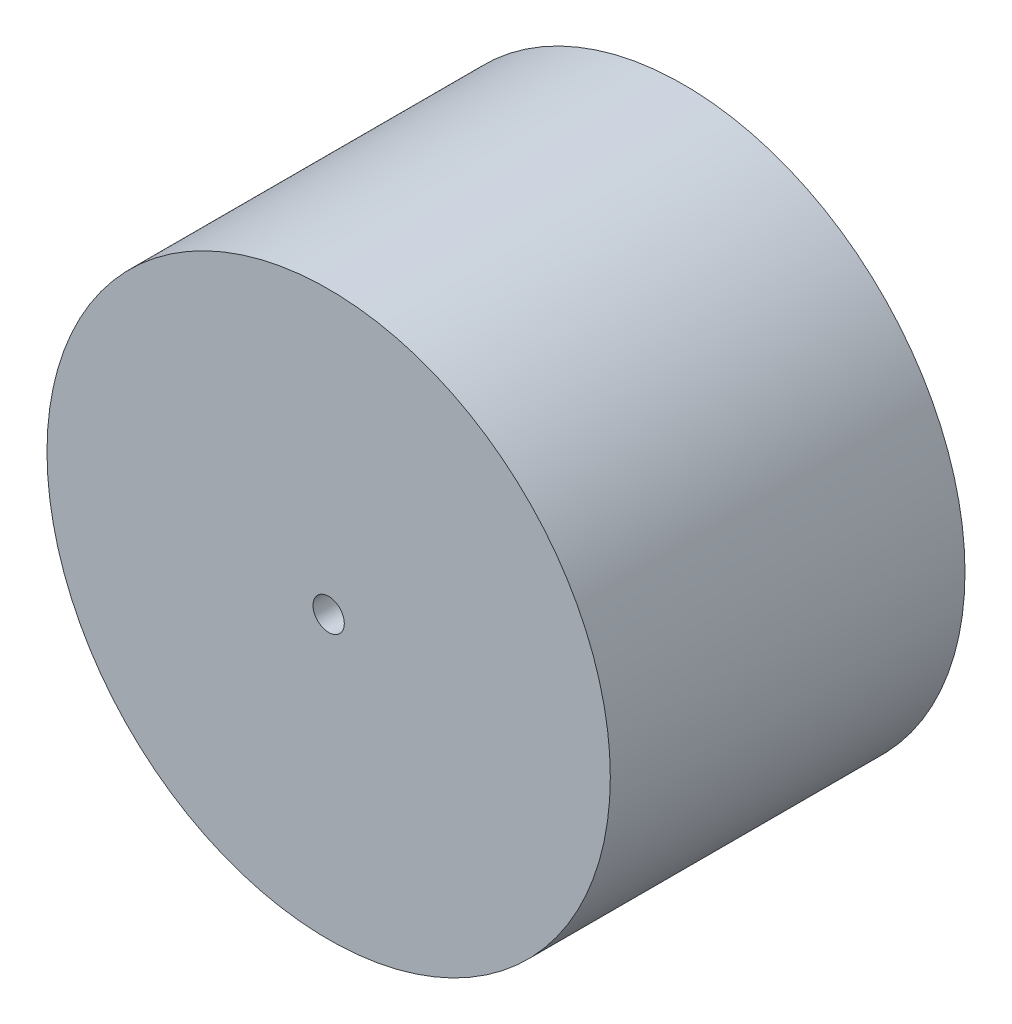
ISO-10303-21;
HEADER;
FILE_DESCRIPTION(('STEP AP214'),'2;1');
FILE_NAME('part.step','',(''),(''),'','','');
FILE_SCHEMA(('AUTOMOTIVE_DESIGN { 1 0 10303 214 1 1 1 1 }'));
ENDSEC;
DATA;
#1=APPLICATION_CONTEXT('core data for automotive mechanical design processes');
#2=APPLICATION_PROTOCOL_DEFINITION('international standard','automotive_design',2000,#1);
#3=PRODUCT_CONTEXT('',#1,'mechanical');
#4=PRODUCT('Part','Part','',(#3));
#5=PRODUCT_RELATED_PRODUCT_CATEGORY('part','',(#4));
#6=PRODUCT_DEFINITION_FORMATION('','',#4);
#7=PRODUCT_DEFINITION_CONTEXT('part definition',#1,'design');
#8=PRODUCT_DEFINITION('design','',#6,#7);
#9=PRODUCT_DEFINITION_SHAPE('','',#8);
#10=(LENGTH_UNIT() NAMED_UNIT(*) SI_UNIT(.MILLI.,.METRE.));
#11=(NAMED_UNIT(*) PLANE_ANGLE_UNIT() SI_UNIT($,.RADIAN.));
#12=(NAMED_UNIT(*) SI_UNIT($,.STERADIAN.) SOLID_ANGLE_UNIT());
#13=UNCERTAINTY_MEASURE_WITH_UNIT(LENGTH_MEASURE(1.E-05),#10,'distance_accuracy_value','');
#14=(GEOMETRIC_REPRESENTATION_CONTEXT(3) GLOBAL_UNCERTAINTY_ASSIGNED_CONTEXT((#13)) GLOBAL_UNIT_ASSIGNED_CONTEXT((#10,
#11,#12)) REPRESENTATION_CONTEXT('',''));
#15=CARTESIAN_POINT('',(0.,0.,0.));
#16=DIRECTION('',(0.,0.,1.));
#17=DIRECTION('',(1.,0.,0.));
#18=AXIS2_PLACEMENT_3D('',#15,#16,#17);
#19=CARTESIAN_POINT('',(0.,0.,34.));
#20=DIRECTION('',(0.,0.,1.));
#21=DIRECTION('',(1.,0.,0.));
#22=AXIS2_PLACEMENT_3D('',#19,#20,#21);
#23=PLANE('',#22);
#24=CARTESIAN_POINT('',(0.,0.,34.));
#25=DIRECTION('',(0.,0.,1.));
#26=DIRECTION('',(1.,0.,0.));
#27=AXIS2_PLACEMENT_3D('',#24,#25,#26);
#28=CIRCLE('',#27,27.);
#29=CARTESIAN_POINT('',(27.,0.,34.));
#30=VERTEX_POINT('',#29);
#31=EDGE_CURVE('E10',#30,#30,#28,.T.);
#32=ORIENTED_EDGE('',*,*,#31,.T.);
#33=EDGE_LOOP('',(#32));
#34=FACE_BOUND('',#33,.T.);
#35=CARTESIAN_POINT('',(0.,0.,34.));
#36=DIRECTION('',(0.,0.,1.));
#37=DIRECTION('',(1.,0.,0.));
#38=AXIS2_PLACEMENT_3D('',#35,#36,#37);
#39=CIRCLE('',#38,1.5);
#40=CARTESIAN_POINT('',(1.5,0.,34.));
#41=VERTEX_POINT('',#40);
#42=EDGE_CURVE('E42',#41,#41,#39,.T.);
#43=ORIENTED_EDGE('',*,*,#42,.F.);
#44=EDGE_LOOP('',(#43));
#45=FACE_BOUND('',#44,.T.);
#46=ADVANCED_FACE('F31',(#34,#45),#23,.T.);
#47=CARTESIAN_POINT('',(0.,0.,0.));
#48=DIRECTION('',(0.,0.,1.));
#49=DIRECTION('',(1.,0.,0.));
#50=AXIS2_PLACEMENT_3D('',#47,#48,#49);
#51=PLANE('',#50);
#52=CARTESIAN_POINT('',(0.,0.,0.));
#53=DIRECTION('',(0.,0.,1.));
#54=DIRECTION('',(1.,0.,0.));
#55=AXIS2_PLACEMENT_3D('',#52,#53,#54);
#56=CIRCLE('',#55,27.);
#57=CARTESIAN_POINT('',(27.,0.,0.));
#58=VERTEX_POINT('',#57);
#59=EDGE_CURVE('E35',#58,#58,#56,.T.);
#60=ORIENTED_EDGE('',*,*,#59,.F.);
#61=EDGE_LOOP('',(#60));
#62=FACE_BOUND('',#61,.T.);
#63=CARTESIAN_POINT('',(0.,0.,0.));
#64=DIRECTION('',(0.,0.,1.));
#65=DIRECTION('',(1.,0.,0.));
#66=AXIS2_PLACEMENT_3D('',#63,#64,#65);
#67=CIRCLE('',#66,1.5);
#68=CARTESIAN_POINT('',(1.5,0.,0.));
#69=VERTEX_POINT('',#68);
#70=EDGE_CURVE('E44',#69,#69,#67,.T.);
#71=ORIENTED_EDGE('',*,*,#70,.T.);
#72=EDGE_LOOP('',(#71));
#73=FACE_BOUND('',#72,.T.);
#74=ADVANCED_FACE('F54',(#62,#73),#51,.F.);
#75=CARTESIAN_POINT('',(0.,0.,34.));
#76=DIRECTION('',(0.,0.,-1.));
#77=DIRECTION('',(-1.,0.,0.));
#78=AXIS2_PLACEMENT_3D('',#75,#76,#77);
#79=CYLINDRICAL_SURFACE('',#78,27.);
#80=ORIENTED_EDGE('',*,*,#31,.F.);
#81=EDGE_LOOP('',(#80));
#82=FACE_BOUND('',#81,.T.);
#83=ORIENTED_EDGE('',*,*,#59,.T.);
#84=EDGE_LOOP('',(#83));
#85=FACE_BOUND('',#84,.T.);
#86=ADVANCED_FACE('F33',(#82,#85),#79,.T.);
#87=CARTESIAN_POINT('',(0.,0.,34.));
#88=DIRECTION('',(0.,0.,-1.));
#89=DIRECTION('',(-1.,0.,0.));
#90=AXIS2_PLACEMENT_3D('',#87,#88,#89);
#91=CYLINDRICAL_SURFACE('',#90,1.5);
#92=ORIENTED_EDGE('',*,*,#42,.T.);
#93=EDGE_LOOP('',(#92));
#94=FACE_BOUND('',#93,.T.);
#95=ORIENTED_EDGE('',*,*,#70,.F.);
#96=EDGE_LOOP('',(#95));
#97=FACE_BOUND('',#96,.T.);
#98=ADVANCED_FACE('F50',(#94,#97),#91,.F.);
#99=CLOSED_SHELL('',(#46,#74,#86,#98));
#100=MANIFOLD_SOLID_BREP('B2',#99);
#101=ADVANCED_BREP_SHAPE_REPRESENTATION('',(#18,#100),#14);
#102=SHAPE_DEFINITION_REPRESENTATION(#9,#101);
ENDSEC;
END-ISO-10303-21;
